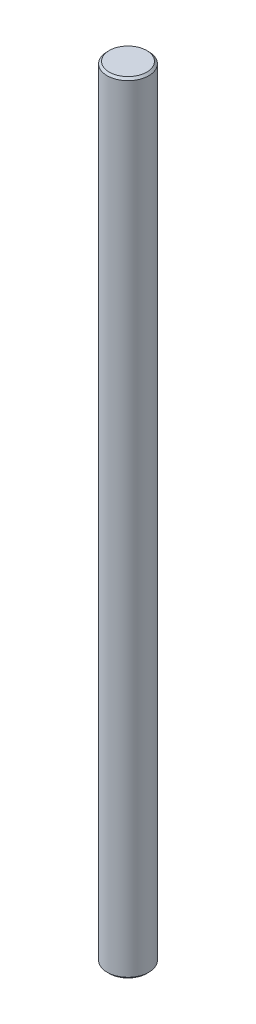
ISO-10303-21;
HEADER;
FILE_DESCRIPTION(('STEP AP214'),'2;1');
FILE_NAME('part.step','',(''),(''),'','','');
FILE_SCHEMA(('AUTOMOTIVE_DESIGN { 1 0 10303 214 1 1 1 1 }'));
ENDSEC;
DATA;
#1=APPLICATION_CONTEXT('core data for automotive mechanical design processes');
#2=APPLICATION_PROTOCOL_DEFINITION('international standard','automotive_design',2000,#1);
#3=PRODUCT_CONTEXT('',#1,'mechanical');
#4=PRODUCT('Part','Part','',(#3));
#5=PRODUCT_RELATED_PRODUCT_CATEGORY('part','',(#4));
#6=PRODUCT_DEFINITION_FORMATION('','',#4);
#7=PRODUCT_DEFINITION_CONTEXT('part definition',#1,'design');
#8=PRODUCT_DEFINITION('design','',#6,#7);
#9=PRODUCT_DEFINITION_SHAPE('','',#8);
#10=(LENGTH_UNIT() NAMED_UNIT(*) SI_UNIT(.MILLI.,.METRE.));
#11=(NAMED_UNIT(*) PLANE_ANGLE_UNIT() SI_UNIT($,.RADIAN.));
#12=(NAMED_UNIT(*) SI_UNIT($,.STERADIAN.) SOLID_ANGLE_UNIT());
#13=UNCERTAINTY_MEASURE_WITH_UNIT(LENGTH_MEASURE(1.E-05),#10,'distance_accuracy_value','');
#14=(GEOMETRIC_REPRESENTATION_CONTEXT(3) GLOBAL_UNCERTAINTY_ASSIGNED_CONTEXT((#13)) GLOBAL_UNIT_ASSIGNED_CONTEXT((#10,
#11,#12)) REPRESENTATION_CONTEXT('',''));
#15=CARTESIAN_POINT('',(0.,0.,0.));
#16=DIRECTION('',(0.,0.,1.));
#17=DIRECTION('',(1.,0.,0.));
#18=AXIS2_PLACEMENT_3D('',#15,#16,#17);
#19=CARTESIAN_POINT('',(0.,37.5,0.));
#20=DIRECTION('',(0.,-1.,0.));
#21=DIRECTION('',(0.,0.,-1.));
#22=AXIS2_PLACEMENT_3D('',#19,#20,#21);
#23=CYLINDRICAL_SURFACE('',#22,2.);
#24=CARTESIAN_POINT('',(0.,-37.3,0.));
#25=DIRECTION('',(0.,1.,0.));
#26=DIRECTION('',(0.,0.,1.));
#27=AXIS2_PLACEMENT_3D('',#24,#25,#26);
#28=CIRCLE('',#27,2.);
#29=CARTESIAN_POINT('',(0.,-37.3,2.));
#30=VERTEX_POINT('',#29);
#31=EDGE_CURVE('E42',#30,#30,#28,.T.);
#32=ORIENTED_EDGE('',*,*,#31,.T.);
#33=EDGE_LOOP('',(#32));
#34=FACE_BOUND('',#33,.T.);
#35=CARTESIAN_POINT('',(0.,37.3,0.));
#36=DIRECTION('',(0.,1.,0.));
#37=DIRECTION('',(0.,0.,1.));
#38=AXIS2_PLACEMENT_3D('',#35,#36,#37);
#39=CIRCLE('',#38,2.);
#40=CARTESIAN_POINT('',(0.,37.3,2.));
#41=VERTEX_POINT('',#40);
#42=EDGE_CURVE('E46',#41,#41,#39,.F.);
#43=ORIENTED_EDGE('',*,*,#42,.T.);
#44=EDGE_LOOP('',(#43));
#45=FACE_BOUND('',#44,.T.);
#46=ADVANCED_FACE('F31',(#34,#45),#23,.T.);
#47=CARTESIAN_POINT('',(0.,37.5,0.));
#48=DIRECTION('',(0.,1.,0.));
#49=DIRECTION('',(0.,0.,1.));
#50=AXIS2_PLACEMENT_3D('',#47,#48,#49);
#51=PLANE('',#50);
#52=CARTESIAN_POINT('',(0.,37.5,0.));
#53=DIRECTION('',(0.,1.,0.));
#54=DIRECTION('',(0.,0.,1.));
#55=AXIS2_PLACEMENT_3D('',#52,#53,#54);
#56=CIRCLE('',#55,1.8);
#57=CARTESIAN_POINT('',(0.,37.5,1.8));
#58=VERTEX_POINT('',#57);
#59=EDGE_CURVE('E10',#58,#58,#56,.T.);
#60=ORIENTED_EDGE('',*,*,#59,.T.);
#61=EDGE_LOOP('',(#60));
#62=FACE_BOUND('',#61,.T.);
#63=ADVANCED_FACE('F62',(#62),#51,.T.);
#64=CARTESIAN_POINT('',(0.,-37.5,0.));
#65=DIRECTION('',(0.,1.,0.));
#66=DIRECTION('',(0.,0.,1.));
#67=AXIS2_PLACEMENT_3D('',#64,#65,#66);
#68=PLANE('',#67);
#69=CARTESIAN_POINT('',(0.,-37.5,0.));
#70=DIRECTION('',(0.,1.,0.));
#71=DIRECTION('',(0.,0.,1.));
#72=AXIS2_PLACEMENT_3D('',#69,#70,#71);
#73=CIRCLE('',#72,1.8);
#74=CARTESIAN_POINT('',(0.,-37.5,1.8));
#75=VERTEX_POINT('',#74);
#76=EDGE_CURVE('E38',#75,#75,#73,.F.);
#77=ORIENTED_EDGE('',*,*,#76,.T.);
#78=EDGE_LOOP('',(#77));
#79=FACE_BOUND('',#78,.T.);
#80=ADVANCED_FACE('F59',(#79),#68,.F.);
#81=CARTESIAN_POINT('',(0.,-37.3,0.));
#82=DIRECTION('',(0.,1.,0.));
#83=DIRECTION('',(0.,0.,1.));
#84=AXIS2_PLACEMENT_3D('',#81,#82,#83);
#85=CONICAL_SURFACE('',#84,2.,0.785398163397444);
#86=ORIENTED_EDGE('',*,*,#76,.F.);
#87=EDGE_LOOP('',(#86));
#88=FACE_BOUND('',#87,.T.);
#89=ORIENTED_EDGE('',*,*,#31,.F.);
#90=EDGE_LOOP('',(#89));
#91=FACE_BOUND('',#90,.T.);
#92=ADVANCED_FACE('F55',(#88,#91),#85,.T.);
#93=CARTESIAN_POINT('',(0.,37.5,0.));
#94=DIRECTION('',(0.,-1.,0.));
#95=DIRECTION('',(0.,0.,-1.));
#96=AXIS2_PLACEMENT_3D('',#93,#94,#95);
#97=CONICAL_SURFACE('',#96,1.8,0.785398163397461);
#98=ORIENTED_EDGE('',*,*,#42,.F.);
#99=EDGE_LOOP('',(#98));
#100=FACE_BOUND('',#99,.T.);
#101=ORIENTED_EDGE('',*,*,#59,.F.);
#102=EDGE_LOOP('',(#101));
#103=FACE_BOUND('',#102,.T.);
#104=ADVANCED_FACE('F33',(#100,#103),#97,.T.);
#105=CLOSED_SHELL('',(#46,#63,#80,#92,#104));
#106=MANIFOLD_SOLID_BREP('B2',#105);
#107=ADVANCED_BREP_SHAPE_REPRESENTATION('',(#18,#106),#14);
#108=SHAPE_DEFINITION_REPRESENTATION(#9,#107);
ENDSEC;
END-ISO-10303-21;
